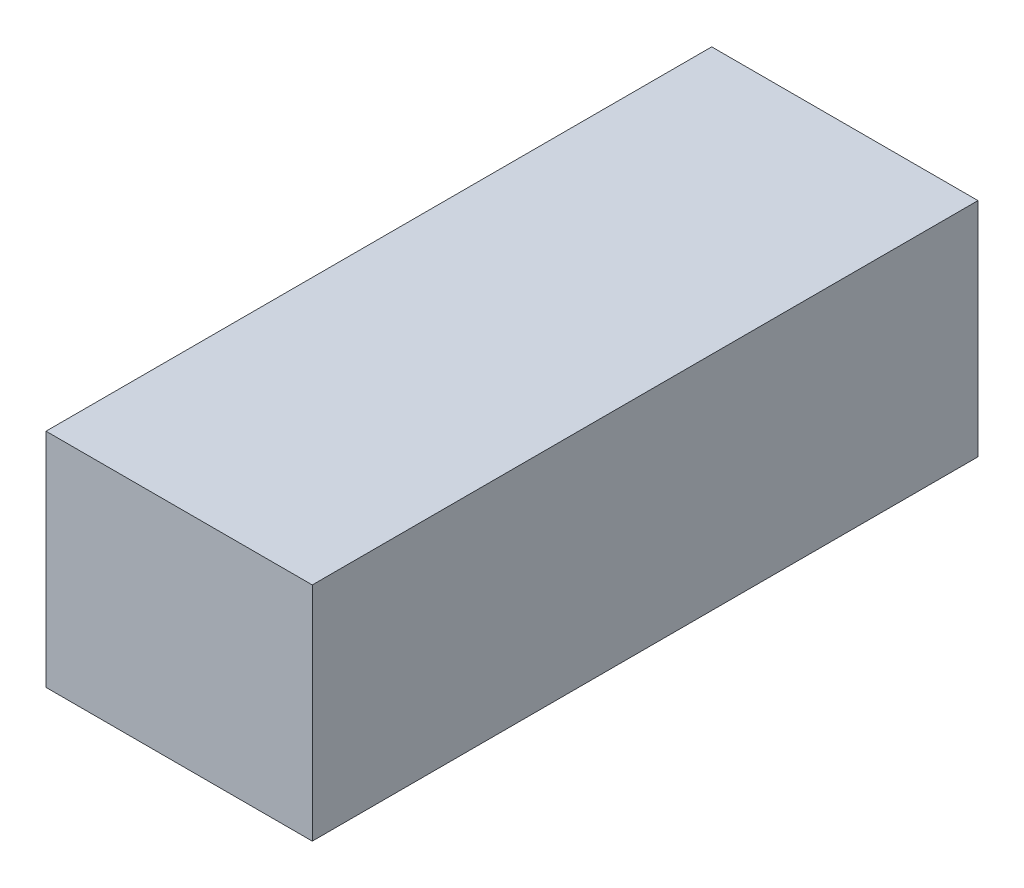
ISO-10303-21;
HEADER;
FILE_DESCRIPTION(('STEP AP214'),'2;1');
FILE_NAME('part.step','',(''),(''),'','','');
FILE_SCHEMA(('AUTOMOTIVE_DESIGN { 1 0 10303 214 1 1 1 1 }'));
ENDSEC;
DATA;
#1=APPLICATION_CONTEXT('core data for automotive mechanical design processes');
#2=APPLICATION_PROTOCOL_DEFINITION('international standard','automotive_design',2000,#1);
#3=PRODUCT_CONTEXT('',#1,'mechanical');
#4=PRODUCT('Part','Part','',(#3));
#5=PRODUCT_RELATED_PRODUCT_CATEGORY('part','',(#4));
#6=PRODUCT_DEFINITION_FORMATION('','',#4);
#7=PRODUCT_DEFINITION_CONTEXT('part definition',#1,'design');
#8=PRODUCT_DEFINITION('design','',#6,#7);
#9=PRODUCT_DEFINITION_SHAPE('','',#8);
#10=(LENGTH_UNIT() NAMED_UNIT(*) SI_UNIT(.MILLI.,.METRE.));
#11=(NAMED_UNIT(*) PLANE_ANGLE_UNIT() SI_UNIT($,.RADIAN.));
#12=(NAMED_UNIT(*) SI_UNIT($,.STERADIAN.) SOLID_ANGLE_UNIT());
#13=UNCERTAINTY_MEASURE_WITH_UNIT(LENGTH_MEASURE(1.E-05),#10,'distance_accuracy_value','');
#14=(GEOMETRIC_REPRESENTATION_CONTEXT(3) GLOBAL_UNCERTAINTY_ASSIGNED_CONTEXT((#13)) GLOBAL_UNIT_ASSIGNED_CONTEXT((#10,
#11,#12)) REPRESENTATION_CONTEXT('',''));
#15=CARTESIAN_POINT('',(0.,0.,0.));
#16=DIRECTION('',(0.,0.,1.));
#17=DIRECTION('',(1.,0.,0.));
#18=AXIS2_PLACEMENT_3D('',#15,#16,#17);
#19=CARTESIAN_POINT('',(16.3306451612903,15.,22.5));
#20=DIRECTION('',(-1.,0.,0.));
#21=DIRECTION('',(0.,0.,1.));
#22=AXIS2_PLACEMENT_3D('',#19,#20,#21);
#23=PLANE('',#22);
#24=DIRECTION('',(0.,0.,-1.));
#25=VECTOR('',#24,1.);
#26=CARTESIAN_POINT('',(16.3306451612903,0.,22.5));
#27=LINE('',#26,#25);
#28=CARTESIAN_POINT('',(16.3306451612903,0.,22.5));
#29=VERTEX_POINT('',#28);
#30=CARTESIAN_POINT('',(16.3306451612903,0.,-22.5));
#31=VERTEX_POINT('',#30);
#32=EDGE_CURVE('E113',#29,#31,#27,.T.);
#33=ORIENTED_EDGE('',*,*,#32,.T.);
#34=DIRECTION('',(0.,-1.,0.));
#35=VECTOR('',#34,1.);
#36=CARTESIAN_POINT('',(16.3306451612903,15.,-22.5));
#37=LINE('',#36,#35);
#38=CARTESIAN_POINT('',(16.3306451612903,15.,-22.5));
#39=VERTEX_POINT('',#38);
#40=EDGE_CURVE('E11',#39,#31,#37,.T.);
#41=ORIENTED_EDGE('',*,*,#40,.F.);
#42=DIRECTION('',(0.,0.,-1.));
#43=VECTOR('',#42,1.);
#44=CARTESIAN_POINT('',(16.3306451612903,15.,22.5));
#45=LINE('',#44,#43);
#46=CARTESIAN_POINT('',(16.3306451612903,15.,22.5));
#47=VERTEX_POINT('',#46);
#48=EDGE_CURVE('E97',#47,#39,#45,.T.);
#49=ORIENTED_EDGE('',*,*,#48,.F.);
#50=DIRECTION('',(0.,-1.,0.));
#51=VECTOR('',#50,1.);
#52=CARTESIAN_POINT('',(16.3306451612903,15.,22.5));
#53=LINE('',#52,#51);
#54=EDGE_CURVE('E109',#47,#29,#53,.T.);
#55=ORIENTED_EDGE('',*,*,#54,.T.);
#56=EDGE_LOOP('',(#33,#41,#49,#55));
#57=FACE_BOUND('',#56,.T.);
#58=ADVANCED_FACE('F45',(#57),#23,.F.);
#59=CARTESIAN_POINT('',(-1.66935483870973,15.,-22.5));
#60=DIRECTION('',(0.,0.,1.));
#61=DIRECTION('',(1.,0.,0.));
#62=AXIS2_PLACEMENT_3D('',#59,#60,#61);
#63=PLANE('',#62);
#64=DIRECTION('',(-1.,0.,0.));
#65=VECTOR('',#64,1.);
#66=CARTESIAN_POINT('',(-1.66935483870973,0.,-22.5));
#67=LINE('',#66,#65);
#68=CARTESIAN_POINT('',(-1.66935483870973,0.,-22.5));
#69=VERTEX_POINT('',#68);
#70=EDGE_CURVE('E102',#31,#69,#67,.T.);
#71=ORIENTED_EDGE('',*,*,#70,.T.);
#72=DIRECTION('',(0.,-1.,0.));
#73=VECTOR('',#72,1.);
#74=CARTESIAN_POINT('',(-1.66935483870973,15.,-22.5));
#75=LINE('',#74,#73);
#76=CARTESIAN_POINT('',(-1.66935483870973,15.,-22.5));
#77=VERTEX_POINT('',#76);
#78=EDGE_CURVE('E54',#77,#69,#75,.T.);
#79=ORIENTED_EDGE('',*,*,#78,.F.);
#80=DIRECTION('',(-1.,0.,0.));
#81=VECTOR('',#80,1.);
#82=CARTESIAN_POINT('',(-1.66935483870973,15.,-22.5));
#83=LINE('',#82,#81);
#84=EDGE_CURVE('E92',#39,#77,#83,.T.);
#85=ORIENTED_EDGE('',*,*,#84,.F.);
#86=ORIENTED_EDGE('',*,*,#40,.T.);
#87=EDGE_LOOP('',(#71,#79,#85,#86));
#88=FACE_BOUND('',#87,.T.);
#89=ADVANCED_FACE('F101',(#88),#63,.F.);
#90=CARTESIAN_POINT('',(-1.66935483870973,15.,22.5));
#91=DIRECTION('',(1.,0.,0.));
#92=DIRECTION('',(0.,0.,-1.));
#93=AXIS2_PLACEMENT_3D('',#90,#91,#92);
#94=PLANE('',#93);
#95=DIRECTION('',(0.,0.,1.));
#96=VECTOR('',#95,1.);
#97=CARTESIAN_POINT('',(-1.66935483870973,0.,22.5));
#98=LINE('',#97,#96);
#99=CARTESIAN_POINT('',(-1.66935483870973,0.,22.5));
#100=VERTEX_POINT('',#99);
#101=EDGE_CURVE('E79',#69,#100,#98,.T.);
#102=ORIENTED_EDGE('',*,*,#101,.T.);
#103=DIRECTION('',(0.,-1.,0.));
#104=VECTOR('',#103,1.);
#105=CARTESIAN_POINT('',(-1.66935483870973,15.,22.5));
#106=LINE('',#105,#104);
#107=CARTESIAN_POINT('',(-1.66935483870973,15.,22.5));
#108=VERTEX_POINT('',#107);
#109=EDGE_CURVE('E104',#108,#100,#106,.T.);
#110=ORIENTED_EDGE('',*,*,#109,.F.);
#111=DIRECTION('',(0.,0.,1.));
#112=VECTOR('',#111,1.);
#113=CARTESIAN_POINT('',(-1.66935483870973,15.,22.5));
#114=LINE('',#113,#112);
#115=EDGE_CURVE('E95',#77,#108,#114,.T.);
#116=ORIENTED_EDGE('',*,*,#115,.F.);
#117=ORIENTED_EDGE('',*,*,#78,.T.);
#118=EDGE_LOOP('',(#102,#110,#116,#117));
#119=FACE_BOUND('',#118,.T.);
#120=ADVANCED_FACE('F105',(#119),#94,.F.);
#121=CARTESIAN_POINT('',(-1.66935483870973,15.,22.5));
#122=DIRECTION('',(0.,0.,-1.));
#123=DIRECTION('',(-1.,0.,0.));
#124=AXIS2_PLACEMENT_3D('',#121,#122,#123);
#125=PLANE('',#124);
#126=DIRECTION('',(1.,0.,0.));
#127=VECTOR('',#126,1.);
#128=CARTESIAN_POINT('',(-1.66935483870973,0.,22.5));
#129=LINE('',#128,#127);
#130=EDGE_CURVE('E85',#100,#29,#129,.T.);
#131=ORIENTED_EDGE('',*,*,#130,.T.);
#132=ORIENTED_EDGE('',*,*,#54,.F.);
#133=DIRECTION('',(1.,0.,0.));
#134=VECTOR('',#133,1.);
#135=CARTESIAN_POINT('',(-1.66935483870973,15.,22.5));
#136=LINE('',#135,#134);
#137=EDGE_CURVE('E62',#108,#47,#136,.T.);
#138=ORIENTED_EDGE('',*,*,#137,.F.);
#139=ORIENTED_EDGE('',*,*,#109,.T.);
#140=EDGE_LOOP('',(#131,#132,#138,#139));
#141=FACE_BOUND('',#140,.T.);
#142=ADVANCED_FACE('F126',(#141),#125,.F.);
#143=CARTESIAN_POINT('',(0.,15.,0.));
#144=DIRECTION('',(0.,-1.,0.));
#145=DIRECTION('',(0.,0.,-1.));
#146=AXIS2_PLACEMENT_3D('',#143,#144,#145);
#147=PLANE('',#146);
#148=ORIENTED_EDGE('',*,*,#48,.T.);
#149=ORIENTED_EDGE('',*,*,#84,.T.);
#150=ORIENTED_EDGE('',*,*,#115,.T.);
#151=ORIENTED_EDGE('',*,*,#137,.T.);
#152=EDGE_LOOP('',(#148,#149,#150,#151));
#153=FACE_BOUND('',#152,.T.);
#154=ADVANCED_FACE('F93',(#153),#147,.F.);
#155=CARTESIAN_POINT('',(0.,0.,0.));
#156=DIRECTION('',(0.,-1.,0.));
#157=DIRECTION('',(0.,0.,-1.));
#158=AXIS2_PLACEMENT_3D('',#155,#156,#157);
#159=PLANE('',#158);
#160=ORIENTED_EDGE('',*,*,#32,.F.);
#161=ORIENTED_EDGE('',*,*,#130,.F.);
#162=ORIENTED_EDGE('',*,*,#101,.F.);
#163=ORIENTED_EDGE('',*,*,#70,.F.);
#164=EDGE_LOOP('',(#160,#161,#162,#163));
#165=FACE_BOUND('',#164,.T.);
#166=ADVANCED_FACE('F129',(#165),#159,.T.);
#167=CLOSED_SHELL('',(#58,#89,#120,#142,#154,#166));
#168=MANIFOLD_SOLID_BREP('B2',#167);
#169=ADVANCED_BREP_SHAPE_REPRESENTATION('',(#18,#168),#14);
#170=SHAPE_DEFINITION_REPRESENTATION(#9,#169);
ENDSEC;
END-ISO-10303-21;
